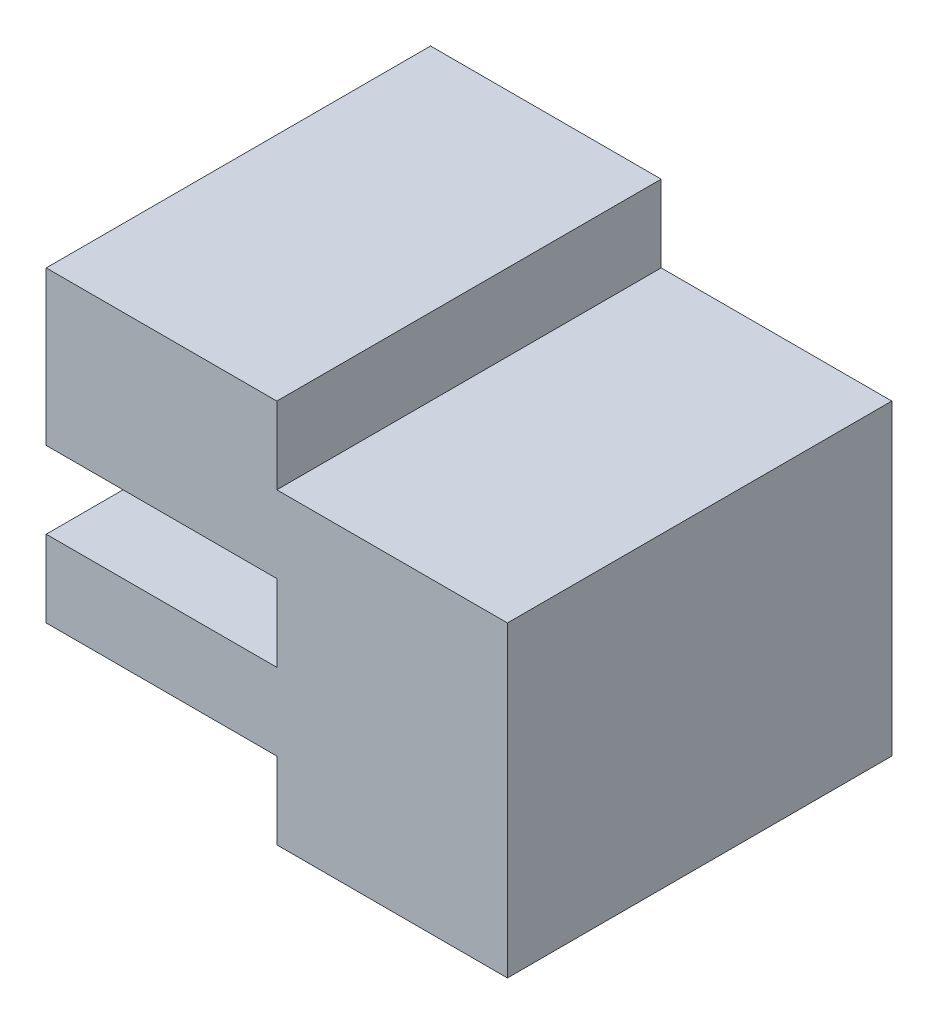
ISO-10303-21;
HEADER;
FILE_DESCRIPTION(('STEP AP214'),'2;1');
FILE_NAME('part.step','',(''),(''),'','','');
FILE_SCHEMA(('AUTOMOTIVE_DESIGN { 1 0 10303 214 1 1 1 1 }'));
ENDSEC;
DATA;
#1=APPLICATION_CONTEXT('core data for automotive mechanical design processes');
#2=APPLICATION_PROTOCOL_DEFINITION('international standard','automotive_design',2000,#1);
#3=PRODUCT_CONTEXT('',#1,'mechanical');
#4=PRODUCT('Part','Part','',(#3));
#5=PRODUCT_RELATED_PRODUCT_CATEGORY('part','',(#4));
#6=PRODUCT_DEFINITION_FORMATION('','',#4);
#7=PRODUCT_DEFINITION_CONTEXT('part definition',#1,'design');
#8=PRODUCT_DEFINITION('design','',#6,#7);
#9=PRODUCT_DEFINITION_SHAPE('','',#8);
#10=(LENGTH_UNIT() NAMED_UNIT(*) SI_UNIT(.MILLI.,.METRE.));
#11=(NAMED_UNIT(*) PLANE_ANGLE_UNIT() SI_UNIT($,.RADIAN.));
#12=(NAMED_UNIT(*) SI_UNIT($,.STERADIAN.) SOLID_ANGLE_UNIT());
#13=UNCERTAINTY_MEASURE_WITH_UNIT(LENGTH_MEASURE(1.E-05),#10,'distance_accuracy_value','');
#14=(GEOMETRIC_REPRESENTATION_CONTEXT(3) GLOBAL_UNCERTAINTY_ASSIGNED_CONTEXT((#13)) GLOBAL_UNIT_ASSIGNED_CONTEXT((#10,
#11,#12)) REPRESENTATION_CONTEXT('',''));
#15=CARTESIAN_POINT('',(0.,0.,0.));
#16=DIRECTION('',(0.,0.,1.));
#17=DIRECTION('',(1.,0.,0.));
#18=AXIS2_PLACEMENT_3D('',#15,#16,#17);
#19=CARTESIAN_POINT('',(-30.,15.,25.));
#20=DIRECTION('',(1.,0.,0.));
#21=DIRECTION('',(0.,1.,0.));
#22=AXIS2_PLACEMENT_3D('',#19,#20,#21);
#23=PLANE('',#22);
#24=DIRECTION('',(0.,-1.,0.));
#25=VECTOR('',#24,1.);
#26=CARTESIAN_POINT('',(-30.,15.,0.));
#27=LINE('',#26,#25);
#28=CARTESIAN_POINT('',(-30.,25.,0.));
#29=VERTEX_POINT('',#28);
#30=CARTESIAN_POINT('',(-30.,15.,0.));
#31=VERTEX_POINT('',#30);
#32=EDGE_CURVE('E153',#29,#31,#27,.T.);
#33=ORIENTED_EDGE('',*,*,#32,.T.);
#34=DIRECTION('',(0.,0.,-1.));
#35=VECTOR('',#34,1.);
#36=CARTESIAN_POINT('',(-30.,15.,25.));
#37=LINE('',#36,#35);
#38=CARTESIAN_POINT('',(-30.,15.,25.));
#39=VERTEX_POINT('',#38);
#40=EDGE_CURVE('E11',#39,#31,#37,.T.);
#41=ORIENTED_EDGE('',*,*,#40,.F.);
#42=DIRECTION('',(0.,-1.,0.));
#43=VECTOR('',#42,1.);
#44=CARTESIAN_POINT('',(-30.,15.,25.));
#45=LINE('',#44,#43);
#46=CARTESIAN_POINT('',(-30.,25.,25.));
#47=VERTEX_POINT('',#46);
#48=EDGE_CURVE('E175',#47,#39,#45,.T.);
#49=ORIENTED_EDGE('',*,*,#48,.F.);
#50=DIRECTION('',(0.,0.,-1.));
#51=VECTOR('',#50,1.);
#52=CARTESIAN_POINT('',(-30.,25.,25.));
#53=LINE('',#52,#51);
#54=EDGE_CURVE('E149',#47,#29,#53,.T.);
#55=ORIENTED_EDGE('',*,*,#54,.T.);
#56=EDGE_LOOP('',(#33,#41,#49,#55));
#57=FACE_BOUND('',#56,.T.);
#58=ADVANCED_FACE('F33',(#57),#23,.F.);
#59=CARTESIAN_POINT('',(-15.,15.,25.));
#60=DIRECTION('',(0.,1.,0.));
#61=DIRECTION('',(-1.,0.,0.));
#62=AXIS2_PLACEMENT_3D('',#59,#60,#61);
#63=PLANE('',#62);
#64=DIRECTION('',(1.,0.,0.));
#65=VECTOR('',#64,1.);
#66=CARTESIAN_POINT('',(-15.,15.,0.));
#67=LINE('',#66,#65);
#68=CARTESIAN_POINT('',(-15.,15.,0.));
#69=VERTEX_POINT('',#68);
#70=EDGE_CURVE('E156',#31,#69,#67,.T.);
#71=ORIENTED_EDGE('',*,*,#70,.T.);
#72=DIRECTION('',(0.,0.,-1.));
#73=VECTOR('',#72,1.);
#74=CARTESIAN_POINT('',(-15.,15.,25.));
#75=LINE('',#74,#73);
#76=CARTESIAN_POINT('',(-15.,15.,25.));
#77=VERTEX_POINT('',#76);
#78=EDGE_CURVE('E41',#77,#69,#75,.T.);
#79=ORIENTED_EDGE('',*,*,#78,.F.);
#80=DIRECTION('',(1.,0.,0.));
#81=VECTOR('',#80,1.);
#82=CARTESIAN_POINT('',(-15.,15.,25.));
#83=LINE('',#82,#81);
#84=EDGE_CURVE('E104',#39,#77,#83,.T.);
#85=ORIENTED_EDGE('',*,*,#84,.F.);
#86=ORIENTED_EDGE('',*,*,#40,.T.);
#87=EDGE_LOOP('',(#71,#79,#85,#86));
#88=FACE_BOUND('',#87,.T.);
#89=ADVANCED_FACE('F253',(#88),#63,.F.);
#90=CARTESIAN_POINT('',(-15.,10.,25.));
#91=DIRECTION('',(1.,0.,0.));
#92=DIRECTION('',(0.,0.,-1.));
#93=AXIS2_PLACEMENT_3D('',#90,#91,#92);
#94=PLANE('',#93);
#95=DIRECTION('',(0.,-1.,0.));
#96=VECTOR('',#95,1.);
#97=CARTESIAN_POINT('',(-15.,10.,0.));
#98=LINE('',#97,#96);
#99=CARTESIAN_POINT('',(-15.,10.,0.));
#100=VERTEX_POINT('',#99);
#101=EDGE_CURVE('E158',#69,#100,#98,.T.);
#102=ORIENTED_EDGE('',*,*,#101,.T.);
#103=DIRECTION('',(0.,0.,-1.));
#104=VECTOR('',#103,1.);
#105=CARTESIAN_POINT('',(-15.,10.,25.));
#106=LINE('',#105,#104);
#107=CARTESIAN_POINT('',(-15.,10.,25.));
#108=VERTEX_POINT('',#107);
#109=EDGE_CURVE('E194',#108,#100,#106,.T.);
#110=ORIENTED_EDGE('',*,*,#109,.F.);
#111=DIRECTION('',(0.,-1.,0.));
#112=VECTOR('',#111,1.);
#113=CARTESIAN_POINT('',(-15.,10.,25.));
#114=LINE('',#113,#112);
#115=EDGE_CURVE('E202',#77,#108,#114,.T.);
#116=ORIENTED_EDGE('',*,*,#115,.F.);
#117=ORIENTED_EDGE('',*,*,#78,.T.);
#118=EDGE_LOOP('',(#102,#110,#116,#117));
#119=FACE_BOUND('',#118,.T.);
#120=ADVANCED_FACE('F200',(#119),#94,.F.);
#121=CARTESIAN_POINT('',(-30.,10.,25.));
#122=DIRECTION('',(0.,-1.,0.));
#123=DIRECTION('',(0.,0.,-1.));
#124=AXIS2_PLACEMENT_3D('',#121,#122,#123);
#125=PLANE('',#124);
#126=DIRECTION('',(-1.,0.,0.));
#127=VECTOR('',#126,1.);
#128=CARTESIAN_POINT('',(-30.,10.,0.));
#129=LINE('',#128,#127);
#130=CARTESIAN_POINT('',(-30.,10.,0.));
#131=VERTEX_POINT('',#130);
#132=EDGE_CURVE('E160',#100,#131,#129,.T.);
#133=ORIENTED_EDGE('',*,*,#132,.T.);
#134=DIRECTION('',(0.,0.,-1.));
#135=VECTOR('',#134,1.);
#136=CARTESIAN_POINT('',(-30.,10.,25.));
#137=LINE('',#136,#135);
#138=CARTESIAN_POINT('',(-30.,10.,25.));
#139=VERTEX_POINT('',#138);
#140=EDGE_CURVE('E191',#139,#131,#137,.T.);
#141=ORIENTED_EDGE('',*,*,#140,.F.);
#142=DIRECTION('',(-1.,0.,0.));
#143=VECTOR('',#142,1.);
#144=CARTESIAN_POINT('',(-30.,10.,25.));
#145=LINE('',#144,#143);
#146=EDGE_CURVE('E220',#108,#139,#145,.T.);
#147=ORIENTED_EDGE('',*,*,#146,.F.);
#148=ORIENTED_EDGE('',*,*,#109,.T.);
#149=EDGE_LOOP('',(#133,#141,#147,#148));
#150=FACE_BOUND('',#149,.T.);
#151=ADVANCED_FACE('F211',(#150),#125,.F.);
#152=CARTESIAN_POINT('',(-30.,5.00000000000001,25.));
#153=DIRECTION('',(1.,0.,0.));
#154=DIRECTION('',(0.,0.,-1.));
#155=AXIS2_PLACEMENT_3D('',#152,#153,#154);
#156=PLANE('',#155);
#157=DIRECTION('',(0.,-1.,0.));
#158=VECTOR('',#157,1.);
#159=CARTESIAN_POINT('',(-30.,5.00000000000001,0.));
#160=LINE('',#159,#158);
#161=CARTESIAN_POINT('',(-30.,5.00000000000001,0.));
#162=VERTEX_POINT('',#161);
#163=EDGE_CURVE('E162',#131,#162,#160,.T.);
#164=ORIENTED_EDGE('',*,*,#163,.T.);
#165=DIRECTION('',(0.,0.,-1.));
#166=VECTOR('',#165,1.);
#167=CARTESIAN_POINT('',(-30.,5.00000000000001,25.));
#168=LINE('',#167,#166);
#169=CARTESIAN_POINT('',(-30.,5.00000000000001,25.));
#170=VERTEX_POINT('',#169);
#171=EDGE_CURVE('E188',#170,#162,#168,.T.);
#172=ORIENTED_EDGE('',*,*,#171,.F.);
#173=DIRECTION('',(0.,-1.,0.));
#174=VECTOR('',#173,1.);
#175=CARTESIAN_POINT('',(-30.,5.00000000000001,25.));
#176=LINE('',#175,#174);
#177=EDGE_CURVE('E217',#139,#170,#176,.T.);
#178=ORIENTED_EDGE('',*,*,#177,.F.);
#179=ORIENTED_EDGE('',*,*,#140,.T.);
#180=EDGE_LOOP('',(#164,#172,#178,#179));
#181=FACE_BOUND('',#180,.T.);
#182=ADVANCED_FACE('F215',(#181),#156,.F.);
#183=CARTESIAN_POINT('',(-15.,5.00000000000001,25.));
#184=DIRECTION('',(0.,1.,0.));
#185=DIRECTION('',(-1.,0.,0.));
#186=AXIS2_PLACEMENT_3D('',#183,#184,#185);
#187=PLANE('',#186);
#188=DIRECTION('',(1.,0.,0.));
#189=VECTOR('',#188,1.);
#190=CARTESIAN_POINT('',(-15.,5.00000000000001,0.));
#191=LINE('',#190,#189);
#192=CARTESIAN_POINT('',(-15.,5.00000000000001,0.));
#193=VERTEX_POINT('',#192);
#194=EDGE_CURVE('E164',#162,#193,#191,.T.);
#195=ORIENTED_EDGE('',*,*,#194,.T.);
#196=DIRECTION('',(0.,0.,-1.));
#197=VECTOR('',#196,1.);
#198=CARTESIAN_POINT('',(-15.,5.00000000000001,25.));
#199=LINE('',#198,#197);
#200=CARTESIAN_POINT('',(-15.,5.00000000000001,25.));
#201=VERTEX_POINT('',#200);
#202=EDGE_CURVE('E185',#201,#193,#199,.T.);
#203=ORIENTED_EDGE('',*,*,#202,.F.);
#204=DIRECTION('',(1.,0.,0.));
#205=VECTOR('',#204,1.);
#206=CARTESIAN_POINT('',(-15.,5.00000000000001,25.));
#207=LINE('',#206,#205);
#208=EDGE_CURVE('E219',#170,#201,#207,.T.);
#209=ORIENTED_EDGE('',*,*,#208,.F.);
#210=ORIENTED_EDGE('',*,*,#171,.T.);
#211=EDGE_LOOP('',(#195,#203,#209,#210));
#212=FACE_BOUND('',#211,.T.);
#213=ADVANCED_FACE('F266',(#212),#187,.F.);
#214=CARTESIAN_POINT('',(-15.,0.,25.));
#215=DIRECTION('',(1.,0.,0.));
#216=DIRECTION('',(0.,0.,-1.));
#217=AXIS2_PLACEMENT_3D('',#214,#215,#216);
#218=PLANE('',#217);
#219=DIRECTION('',(0.,-1.,0.));
#220=VECTOR('',#219,1.);
#221=CARTESIAN_POINT('',(-15.,0.,0.));
#222=LINE('',#221,#220);
#223=CARTESIAN_POINT('',(-15.,0.,0.));
#224=VERTEX_POINT('',#223);
#225=EDGE_CURVE('E166',#193,#224,#222,.T.);
#226=ORIENTED_EDGE('',*,*,#225,.T.);
#227=DIRECTION('',(0.,0.,-1.));
#228=VECTOR('',#227,1.);
#229=CARTESIAN_POINT('',(-15.,0.,25.));
#230=LINE('',#229,#228);
#231=CARTESIAN_POINT('',(-15.,0.,25.));
#232=VERTEX_POINT('',#231);
#233=EDGE_CURVE('E182',#232,#224,#230,.T.);
#234=ORIENTED_EDGE('',*,*,#233,.F.);
#235=DIRECTION('',(0.,-1.,0.));
#236=VECTOR('',#235,1.);
#237=CARTESIAN_POINT('',(-15.,0.,25.));
#238=LINE('',#237,#236);
#239=EDGE_CURVE('E222',#201,#232,#238,.T.);
#240=ORIENTED_EDGE('',*,*,#239,.F.);
#241=ORIENTED_EDGE('',*,*,#202,.T.);
#242=EDGE_LOOP('',(#226,#234,#240,#241));
#243=FACE_BOUND('',#242,.T.);
#244=ADVANCED_FACE('F269',(#243),#218,.F.);
#245=CARTESIAN_POINT('',(0.,0.,25.));
#246=DIRECTION('',(0.,1.,0.));
#247=DIRECTION('',(0.,0.,1.));
#248=AXIS2_PLACEMENT_3D('',#245,#246,#247);
#249=PLANE('',#248);
#250=DIRECTION('',(1.,0.,0.));
#251=VECTOR('',#250,1.);
#252=CARTESIAN_POINT('',(0.,0.,0.));
#253=LINE('',#252,#251);
#254=CARTESIAN_POINT('',(0.,0.,0.));
#255=VERTEX_POINT('',#254);
#256=EDGE_CURVE('E168',#224,#255,#253,.T.);
#257=ORIENTED_EDGE('',*,*,#256,.T.);
#258=DIRECTION('',(0.,0.,-1.));
#259=VECTOR('',#258,1.);
#260=CARTESIAN_POINT('',(0.,0.,25.));
#261=LINE('',#260,#259);
#262=CARTESIAN_POINT('',(0.,0.,25.));
#263=VERTEX_POINT('',#262);
#264=EDGE_CURVE('E179',#263,#255,#261,.T.);
#265=ORIENTED_EDGE('',*,*,#264,.F.);
#266=DIRECTION('',(1.,0.,0.));
#267=VECTOR('',#266,1.);
#268=CARTESIAN_POINT('',(0.,0.,25.));
#269=LINE('',#268,#267);
#270=EDGE_CURVE('E228',#232,#263,#269,.T.);
#271=ORIENTED_EDGE('',*,*,#270,.F.);
#272=ORIENTED_EDGE('',*,*,#233,.T.);
#273=EDGE_LOOP('',(#257,#265,#271,#272));
#274=FACE_BOUND('',#273,.T.);
#275=ADVANCED_FACE('F234',(#274),#249,.F.);
#276=CARTESIAN_POINT('',(0.,20.,25.));
#277=DIRECTION('',(-1.,0.,0.));
#278=DIRECTION('',(0.,-1.,0.));
#279=AXIS2_PLACEMENT_3D('',#276,#277,#278);
#280=PLANE('',#279);
#281=DIRECTION('',(0.,1.,0.));
#282=VECTOR('',#281,1.);
#283=CARTESIAN_POINT('',(0.,20.,0.));
#284=LINE('',#283,#282);
#285=CARTESIAN_POINT('',(0.,20.,0.));
#286=VERTEX_POINT('',#285);
#287=EDGE_CURVE('E170',#255,#286,#284,.T.);
#288=ORIENTED_EDGE('',*,*,#287,.T.);
#289=DIRECTION('',(0.,0.,-1.));
#290=VECTOR('',#289,1.);
#291=CARTESIAN_POINT('',(0.,20.,25.));
#292=LINE('',#291,#290);
#293=CARTESIAN_POINT('',(0.,20.,25.));
#294=VERTEX_POINT('',#293);
#295=EDGE_CURVE('E144',#294,#286,#292,.T.);
#296=ORIENTED_EDGE('',*,*,#295,.F.);
#297=DIRECTION('',(0.,1.,0.));
#298=VECTOR('',#297,1.);
#299=CARTESIAN_POINT('',(0.,20.,25.));
#300=LINE('',#299,#298);
#301=EDGE_CURVE('E135',#263,#294,#300,.T.);
#302=ORIENTED_EDGE('',*,*,#301,.F.);
#303=ORIENTED_EDGE('',*,*,#264,.T.);
#304=EDGE_LOOP('',(#288,#296,#302,#303));
#305=FACE_BOUND('',#304,.T.);
#306=ADVANCED_FACE('F238',(#305),#280,.F.);
#307=CARTESIAN_POINT('',(-15.,20.,25.));
#308=DIRECTION('',(0.,-1.,0.));
#309=DIRECTION('',(0.,0.,-1.));
#310=AXIS2_PLACEMENT_3D('',#307,#308,#309);
#311=PLANE('',#310);
#312=DIRECTION('',(-1.,0.,0.));
#313=VECTOR('',#312,1.);
#314=CARTESIAN_POINT('',(-15.,20.,0.));
#315=LINE('',#314,#313);
#316=CARTESIAN_POINT('',(-15.,20.,0.));
#317=VERTEX_POINT('',#316);
#318=EDGE_CURVE('E143',#286,#317,#315,.T.);
#319=ORIENTED_EDGE('',*,*,#318,.T.);
#320=DIRECTION('',(0.,0.,-1.));
#321=VECTOR('',#320,1.);
#322=CARTESIAN_POINT('',(-15.,20.,25.));
#323=LINE('',#322,#321);
#324=CARTESIAN_POINT('',(-15.,20.,25.));
#325=VERTEX_POINT('',#324);
#326=EDGE_CURVE('E140',#325,#317,#323,.T.);
#327=ORIENTED_EDGE('',*,*,#326,.F.);
#328=DIRECTION('',(-1.,0.,0.));
#329=VECTOR('',#328,1.);
#330=CARTESIAN_POINT('',(-15.,20.,25.));
#331=LINE('',#330,#329);
#332=EDGE_CURVE('E129',#294,#325,#331,.T.);
#333=ORIENTED_EDGE('',*,*,#332,.F.);
#334=ORIENTED_EDGE('',*,*,#295,.T.);
#335=EDGE_LOOP('',(#319,#327,#333,#334));
#336=FACE_BOUND('',#335,.T.);
#337=ADVANCED_FACE('F141',(#336),#311,.F.);
#338=CARTESIAN_POINT('',(-15.,25.,25.));
#339=DIRECTION('',(-1.,0.,0.));
#340=DIRECTION('',(0.,-1.,0.));
#341=AXIS2_PLACEMENT_3D('',#338,#339,#340);
#342=PLANE('',#341);
#343=DIRECTION('',(0.,1.,0.));
#344=VECTOR('',#343,1.);
#345=CARTESIAN_POINT('',(-15.,25.,0.));
#346=LINE('',#345,#344);
#347=CARTESIAN_POINT('',(-15.,25.,0.));
#348=VERTEX_POINT('',#347);
#349=EDGE_CURVE('E90',#317,#348,#346,.T.);
#350=ORIENTED_EDGE('',*,*,#349,.T.);
#351=DIRECTION('',(0.,0.,-1.));
#352=VECTOR('',#351,1.);
#353=CARTESIAN_POINT('',(-15.,25.,25.));
#354=LINE('',#353,#352);
#355=CARTESIAN_POINT('',(-15.,25.,25.));
#356=VERTEX_POINT('',#355);
#357=EDGE_CURVE('E145',#356,#348,#354,.T.);
#358=ORIENTED_EDGE('',*,*,#357,.F.);
#359=DIRECTION('',(0.,1.,0.));
#360=VECTOR('',#359,1.);
#361=CARTESIAN_POINT('',(-15.,25.,25.));
#362=LINE('',#361,#360);
#363=EDGE_CURVE('E133',#325,#356,#362,.T.);
#364=ORIENTED_EDGE('',*,*,#363,.F.);
#365=ORIENTED_EDGE('',*,*,#326,.T.);
#366=EDGE_LOOP('',(#350,#358,#364,#365));
#367=FACE_BOUND('',#366,.T.);
#368=ADVANCED_FACE('F147',(#367),#342,.F.);
#369=CARTESIAN_POINT('',(-30.,25.,25.));
#370=DIRECTION('',(0.,-1.,0.));
#371=DIRECTION('',(0.,0.,-1.));
#372=AXIS2_PLACEMENT_3D('',#369,#370,#371);
#373=PLANE('',#372);
#374=DIRECTION('',(-1.,0.,0.));
#375=VECTOR('',#374,1.);
#376=CARTESIAN_POINT('',(-30.,25.,0.));
#377=LINE('',#376,#375);
#378=EDGE_CURVE('E96',#348,#29,#377,.T.);
#379=ORIENTED_EDGE('',*,*,#378,.T.);
#380=ORIENTED_EDGE('',*,*,#54,.F.);
#381=DIRECTION('',(-1.,0.,0.));
#382=VECTOR('',#381,1.);
#383=CARTESIAN_POINT('',(-30.,25.,25.));
#384=LINE('',#383,#382);
#385=EDGE_CURVE('E49',#356,#47,#384,.T.);
#386=ORIENTED_EDGE('',*,*,#385,.F.);
#387=ORIENTED_EDGE('',*,*,#357,.T.);
#388=EDGE_LOOP('',(#379,#380,#386,#387));
#389=FACE_BOUND('',#388,.T.);
#390=ADVANCED_FACE('F242',(#389),#373,.F.);
#391=CARTESIAN_POINT('',(0.,0.,25.));
#392=DIRECTION('',(0.,0.,-1.));
#393=DIRECTION('',(-1.,0.,0.));
#394=AXIS2_PLACEMENT_3D('',#391,#392,#393);
#395=PLANE('',#394);
#396=ORIENTED_EDGE('',*,*,#48,.T.);
#397=ORIENTED_EDGE('',*,*,#84,.T.);
#398=ORIENTED_EDGE('',*,*,#115,.T.);
#399=ORIENTED_EDGE('',*,*,#146,.T.);
#400=ORIENTED_EDGE('',*,*,#177,.T.);
#401=ORIENTED_EDGE('',*,*,#208,.T.);
#402=ORIENTED_EDGE('',*,*,#239,.T.);
#403=ORIENTED_EDGE('',*,*,#270,.T.);
#404=ORIENTED_EDGE('',*,*,#301,.T.);
#405=ORIENTED_EDGE('',*,*,#332,.T.);
#406=ORIENTED_EDGE('',*,*,#363,.T.);
#407=ORIENTED_EDGE('',*,*,#385,.T.);
#408=EDGE_LOOP('',(#396,#397,#398,#399,#400,#401,#402,#403,#404,#405,#406,#407));
#409=FACE_BOUND('',#408,.T.);
#410=ADVANCED_FACE('F131',(#409),#395,.F.);
#411=CARTESIAN_POINT('',(0.,0.,0.));
#412=DIRECTION('',(0.,0.,-1.));
#413=DIRECTION('',(-1.,0.,0.));
#414=AXIS2_PLACEMENT_3D('',#411,#412,#413);
#415=PLANE('',#414);
#416=ORIENTED_EDGE('',*,*,#32,.F.);
#417=ORIENTED_EDGE('',*,*,#378,.F.);
#418=ORIENTED_EDGE('',*,*,#349,.F.);
#419=ORIENTED_EDGE('',*,*,#318,.F.);
#420=ORIENTED_EDGE('',*,*,#287,.F.);
#421=ORIENTED_EDGE('',*,*,#256,.F.);
#422=ORIENTED_EDGE('',*,*,#225,.F.);
#423=ORIENTED_EDGE('',*,*,#194,.F.);
#424=ORIENTED_EDGE('',*,*,#163,.F.);
#425=ORIENTED_EDGE('',*,*,#132,.F.);
#426=ORIENTED_EDGE('',*,*,#101,.F.);
#427=ORIENTED_EDGE('',*,*,#70,.F.);
#428=EDGE_LOOP('',(#416,#417,#418,#419,#420,#421,#422,#423,#424,#425,#426,#427));
#429=FACE_BOUND('',#428,.T.);
#430=ADVANCED_FACE('F206',(#429),#415,.T.);
#431=CLOSED_SHELL('',(#58,#89,#120,#151,#182,#213,#244,#275,#306,#337,#368,#390,#410,#430));
#432=MANIFOLD_SOLID_BREP('B2',#431);
#433=ADVANCED_BREP_SHAPE_REPRESENTATION('',(#18,#432),#14);
#434=SHAPE_DEFINITION_REPRESENTATION(#9,#433);
ENDSEC;
END-ISO-10303-21;
